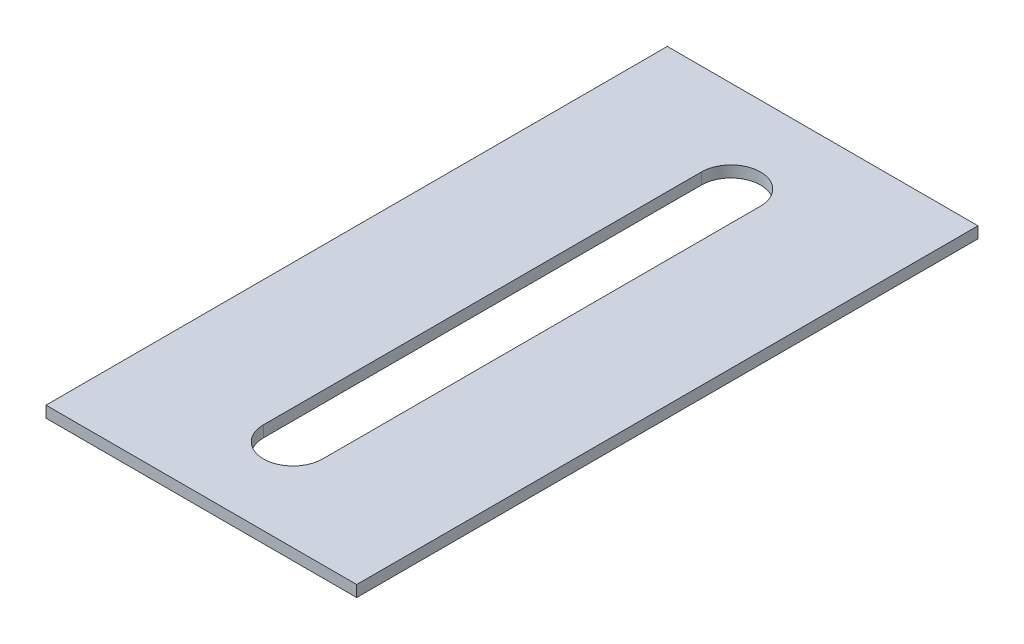
ISO-10303-21;
HEADER;
FILE_DESCRIPTION(('STEP AP214'),'2;1');
FILE_NAME('part.step','',(''),(''),'','','');
FILE_SCHEMA(('AUTOMOTIVE_DESIGN { 1 0 10303 214 1 1 1 1 }'));
ENDSEC;
DATA;
#1=APPLICATION_CONTEXT('core data for automotive mechanical design processes');
#2=APPLICATION_PROTOCOL_DEFINITION('international standard','automotive_design',2000,#1);
#3=PRODUCT_CONTEXT('',#1,'mechanical');
#4=PRODUCT('Part','Part','',(#3));
#5=PRODUCT_RELATED_PRODUCT_CATEGORY('part','',(#4));
#6=PRODUCT_DEFINITION_FORMATION('','',#4);
#7=PRODUCT_DEFINITION_CONTEXT('part definition',#1,'design');
#8=PRODUCT_DEFINITION('design','',#6,#7);
#9=PRODUCT_DEFINITION_SHAPE('','',#8);
#10=(LENGTH_UNIT() NAMED_UNIT(*) SI_UNIT(.MILLI.,.METRE.));
#11=(NAMED_UNIT(*) PLANE_ANGLE_UNIT() SI_UNIT($,.RADIAN.));
#12=(NAMED_UNIT(*) SI_UNIT($,.STERADIAN.) SOLID_ANGLE_UNIT());
#13=UNCERTAINTY_MEASURE_WITH_UNIT(LENGTH_MEASURE(1.E-05),#10,'distance_accuracy_value','');
#14=(GEOMETRIC_REPRESENTATION_CONTEXT(3) GLOBAL_UNCERTAINTY_ASSIGNED_CONTEXT((#13)) GLOBAL_UNIT_ASSIGNED_CONTEXT((#10,
#11,#12)) REPRESENTATION_CONTEXT('',''));
#15=CARTESIAN_POINT('',(0.,0.,0.));
#16=DIRECTION('',(0.,0.,1.));
#17=DIRECTION('',(1.,0.,0.));
#18=AXIS2_PLACEMENT_3D('',#15,#16,#17);
#19=CARTESIAN_POINT('',(25.,-0.9125,-50.));
#20=DIRECTION('',(1.,0.,0.));
#21=DIRECTION('',(0.,0.,-1.));
#22=AXIS2_PLACEMENT_3D('',#19,#20,#21);
#23=PLANE('',#22);
#24=DIRECTION('',(0.,1.,0.));
#25=VECTOR('',#24,1.);
#26=CARTESIAN_POINT('',(25.,-0.9125,-50.));
#27=LINE('',#26,#25);
#28=CARTESIAN_POINT('',(25.,-0.9125,-50.));
#29=VERTEX_POINT('',#28);
#30=CARTESIAN_POINT('',(25.,0.9125,-50.));
#31=VERTEX_POINT('',#30);
#32=EDGE_CURVE('E46',#29,#31,#27,.T.);
#33=ORIENTED_EDGE('',*,*,#32,.T.);
#34=DIRECTION('',(0.,0.,-1.));
#35=VECTOR('',#34,1.);
#36=CARTESIAN_POINT('',(25.,0.9125,-50.));
#37=LINE('',#36,#35);
#38=CARTESIAN_POINT('',(25.,0.9125,50.));
#39=VERTEX_POINT('',#38);
#40=EDGE_CURVE('E144',#39,#31,#37,.T.);
#41=ORIENTED_EDGE('',*,*,#40,.F.);
#42=DIRECTION('',(0.,1.,0.));
#43=VECTOR('',#42,1.);
#44=CARTESIAN_POINT('',(25.,-0.9125,50.));
#45=LINE('',#44,#43);
#46=CARTESIAN_POINT('',(25.,-0.9125,50.));
#47=VERTEX_POINT('',#46);
#48=EDGE_CURVE('E11',#47,#39,#45,.T.);
#49=ORIENTED_EDGE('',*,*,#48,.F.);
#50=DIRECTION('',(0.,0.,-1.));
#51=VECTOR('',#50,1.);
#52=CARTESIAN_POINT('',(25.,-0.9125,-50.));
#53=LINE('',#52,#51);
#54=EDGE_CURVE('E172',#47,#29,#53,.T.);
#55=ORIENTED_EDGE('',*,*,#54,.T.);
#56=EDGE_LOOP('',(#33,#41,#49,#55));
#57=FACE_BOUND('',#56,.T.);
#58=ADVANCED_FACE('F43',(#57),#23,.T.);
#59=CARTESIAN_POINT('',(-25.,-0.9125,50.));
#60=DIRECTION('',(0.,0.,1.));
#61=DIRECTION('',(1.,0.,0.));
#62=AXIS2_PLACEMENT_3D('',#59,#60,#61);
#63=PLANE('',#62);
#64=ORIENTED_EDGE('',*,*,#48,.T.);
#65=DIRECTION('',(1.,0.,0.));
#66=VECTOR('',#65,1.);
#67=CARTESIAN_POINT('',(-25.,0.9125,50.));
#68=LINE('',#67,#66);
#69=CARTESIAN_POINT('',(-25.,0.9125,50.));
#70=VERTEX_POINT('',#69);
#71=EDGE_CURVE('E156',#70,#39,#68,.T.);
#72=ORIENTED_EDGE('',*,*,#71,.F.);
#73=DIRECTION('',(0.,1.,0.));
#74=VECTOR('',#73,1.);
#75=CARTESIAN_POINT('',(-25.,-0.9125,50.));
#76=LINE('',#75,#74);
#77=CARTESIAN_POINT('',(-25.,-0.9125,50.));
#78=VERTEX_POINT('',#77);
#79=EDGE_CURVE('E52',#78,#70,#76,.T.);
#80=ORIENTED_EDGE('',*,*,#79,.F.);
#81=DIRECTION('',(1.,0.,0.));
#82=VECTOR('',#81,1.);
#83=CARTESIAN_POINT('',(-25.,-0.9125,50.));
#84=LINE('',#83,#82);
#85=EDGE_CURVE('E188',#78,#47,#84,.T.);
#86=ORIENTED_EDGE('',*,*,#85,.T.);
#87=EDGE_LOOP('',(#64,#72,#80,#86));
#88=FACE_BOUND('',#87,.T.);
#89=ADVANCED_FACE('F204',(#88),#63,.T.);
#90=CARTESIAN_POINT('',(-25.,-0.9125,-50.));
#91=DIRECTION('',(-1.,0.,0.));
#92=DIRECTION('',(0.,0.,1.));
#93=AXIS2_PLACEMENT_3D('',#90,#91,#92);
#94=PLANE('',#93);
#95=ORIENTED_EDGE('',*,*,#79,.T.);
#96=DIRECTION('',(0.,0.,1.));
#97=VECTOR('',#96,1.);
#98=CARTESIAN_POINT('',(-25.,0.9125,-50.));
#99=LINE('',#98,#97);
#100=CARTESIAN_POINT('',(-25.,0.9125,-50.));
#101=VERTEX_POINT('',#100);
#102=EDGE_CURVE('E152',#101,#70,#99,.T.);
#103=ORIENTED_EDGE('',*,*,#102,.F.);
#104=DIRECTION('',(0.,1.,0.));
#105=VECTOR('',#104,1.);
#106=CARTESIAN_POINT('',(-25.,-0.9125,-50.));
#107=LINE('',#106,#105);
#108=CARTESIAN_POINT('',(-25.,-0.9125,-50.));
#109=VERTEX_POINT('',#108);
#110=EDGE_CURVE('E193',#109,#101,#107,.T.);
#111=ORIENTED_EDGE('',*,*,#110,.F.);
#112=DIRECTION('',(0.,0.,1.));
#113=VECTOR('',#112,1.);
#114=CARTESIAN_POINT('',(-25.,-0.9125,-50.));
#115=LINE('',#114,#113);
#116=EDGE_CURVE('E184',#109,#78,#115,.T.);
#117=ORIENTED_EDGE('',*,*,#116,.T.);
#118=EDGE_LOOP('',(#95,#103,#111,#117));
#119=FACE_BOUND('',#118,.T.);
#120=ADVANCED_FACE('F210',(#119),#94,.T.);
#121=CARTESIAN_POINT('',(-25.,-0.9125,-50.));
#122=DIRECTION('',(0.,0.,-1.));
#123=DIRECTION('',(-1.,0.,0.));
#124=AXIS2_PLACEMENT_3D('',#121,#122,#123);
#125=PLANE('',#124);
#126=ORIENTED_EDGE('',*,*,#110,.T.);
#127=DIRECTION('',(-1.,0.,0.));
#128=VECTOR('',#127,1.);
#129=CARTESIAN_POINT('',(-25.,0.9125,-50.));
#130=LINE('',#129,#128);
#131=EDGE_CURVE('E148',#31,#101,#130,.T.);
#132=ORIENTED_EDGE('',*,*,#131,.F.);
#133=ORIENTED_EDGE('',*,*,#32,.F.);
#134=DIRECTION('',(-1.,0.,0.));
#135=VECTOR('',#134,1.);
#136=CARTESIAN_POINT('',(-25.,-0.9125,-50.));
#137=LINE('',#136,#135);
#138=EDGE_CURVE('E180',#29,#109,#137,.T.);
#139=ORIENTED_EDGE('',*,*,#138,.T.);
#140=EDGE_LOOP('',(#126,#132,#133,#139));
#141=FACE_BOUND('',#140,.T.);
#142=ADVANCED_FACE('F199',(#141),#125,.T.);
#143=CARTESIAN_POINT('',(0.,-0.9125,0.));
#144=DIRECTION('',(0.,1.,0.));
#145=DIRECTION('',(0.,0.,1.));
#146=AXIS2_PLACEMENT_3D('',#143,#144,#145);
#147=PLANE('',#146);
#148=DIRECTION('',(0.,0.,-1.));
#149=VECTOR('',#148,1.);
#150=CARTESIAN_POINT('',(4.7625,-0.9125,-35.2375));
#151=LINE('',#150,#149);
#152=CARTESIAN_POINT('',(4.76250000000001,-0.9125,35.2375));
#153=VERTEX_POINT('',#152);
#154=CARTESIAN_POINT('',(4.7625,-0.9125,-35.2375));
#155=VERTEX_POINT('',#154);
#156=EDGE_CURVE('E122',#153,#155,#151,.T.);
#157=ORIENTED_EDGE('',*,*,#156,.T.);
#158=CARTESIAN_POINT('',(0.,-0.9125,-35.2375));
#159=DIRECTION('',(0.,1.,0.));
#160=DIRECTION('',(0.,0.,1.));
#161=AXIS2_PLACEMENT_3D('',#158,#159,#160);
#162=CIRCLE('',#161,4.7625);
#163=CARTESIAN_POINT('',(-4.7625,-0.9125,-35.2375));
#164=VERTEX_POINT('',#163);
#165=EDGE_CURVE('E160',#155,#164,#162,.T.);
#166=ORIENTED_EDGE('',*,*,#165,.T.);
#167=DIRECTION('',(0.,0.,1.));
#168=VECTOR('',#167,1.);
#169=CARTESIAN_POINT('',(-4.7625,-0.9125,-35.2375));
#170=LINE('',#169,#168);
#171=CARTESIAN_POINT('',(-4.76249999999999,-0.9125,35.2375));
#172=VERTEX_POINT('',#171);
#173=EDGE_CURVE('E116',#164,#172,#170,.T.);
#174=ORIENTED_EDGE('',*,*,#173,.T.);
#175=CARTESIAN_POINT('',(0.,-0.9125,35.2375));
#176=DIRECTION('',(0.,1.,0.));
#177=DIRECTION('',(0.,0.,1.));
#178=AXIS2_PLACEMENT_3D('',#175,#176,#177);
#179=CIRCLE('',#178,4.7625);
#180=EDGE_CURVE('E60',#172,#153,#179,.T.);
#181=ORIENTED_EDGE('',*,*,#180,.T.);
#182=EDGE_LOOP('',(#157,#166,#174,#181));
#183=FACE_BOUND('',#182,.T.);
#184=ORIENTED_EDGE('',*,*,#54,.F.);
#185=ORIENTED_EDGE('',*,*,#85,.F.);
#186=ORIENTED_EDGE('',*,*,#116,.F.);
#187=ORIENTED_EDGE('',*,*,#138,.F.);
#188=EDGE_LOOP('',(#184,#185,#186,#187));
#189=FACE_BOUND('',#188,.T.);
#190=ADVANCED_FACE('F208',(#183,#189),#147,.F.);
#191=CARTESIAN_POINT('',(0.,-0.9125,-35.2375));
#192=DIRECTION('',(0.,1.,0.));
#193=DIRECTION('',(0.,0.,1.));
#194=AXIS2_PLACEMENT_3D('',#191,#192,#193);
#195=CYLINDRICAL_SURFACE('',#194,4.7625);
#196=DIRECTION('',(0.,1.,0.));
#197=VECTOR('',#196,1.);
#198=CARTESIAN_POINT('',(4.7625,-0.9125,-35.2375));
#199=LINE('',#198,#197);
#200=CARTESIAN_POINT('',(4.7625,0.9125,-35.2375));
#201=VERTEX_POINT('',#200);
#202=EDGE_CURVE('E127',#155,#201,#199,.T.);
#203=ORIENTED_EDGE('',*,*,#202,.T.);
#204=CARTESIAN_POINT('',(0.,0.9125,-35.2375));
#205=DIRECTION('',(0.,1.,0.));
#206=DIRECTION('',(0.,0.,1.));
#207=AXIS2_PLACEMENT_3D('',#204,#205,#206);
#208=CIRCLE('',#207,4.7625);
#209=CARTESIAN_POINT('',(-4.7625,0.9125,-35.2375));
#210=VERTEX_POINT('',#209);
#211=EDGE_CURVE('E125',#201,#210,#208,.T.);
#212=ORIENTED_EDGE('',*,*,#211,.T.);
#213=DIRECTION('',(0.,1.,0.));
#214=VECTOR('',#213,1.);
#215=CARTESIAN_POINT('',(-4.7625,-0.9125,-35.2375));
#216=LINE('',#215,#214);
#217=EDGE_CURVE('E109',#164,#210,#216,.T.);
#218=ORIENTED_EDGE('',*,*,#217,.F.);
#219=ORIENTED_EDGE('',*,*,#165,.F.);
#220=EDGE_LOOP('',(#203,#212,#218,#219));
#221=FACE_BOUND('',#220,.T.);
#222=ADVANCED_FACE('F126',(#221),#195,.F.);
#223=CARTESIAN_POINT('',(4.7625,-0.9125,-35.2375));
#224=DIRECTION('',(1.,0.,0.));
#225=DIRECTION('',(0.,0.,-1.));
#226=AXIS2_PLACEMENT_3D('',#223,#224,#225);
#227=PLANE('',#226);
#228=DIRECTION('',(0.,1.,0.));
#229=VECTOR('',#228,1.);
#230=CARTESIAN_POINT('',(4.76250000000001,-0.9125,35.2375));
#231=LINE('',#230,#229);
#232=CARTESIAN_POINT('',(4.76250000000001,0.9125,35.2375));
#233=VERTEX_POINT('',#232);
#234=EDGE_CURVE('E173',#153,#233,#231,.T.);
#235=ORIENTED_EDGE('',*,*,#234,.T.);
#236=DIRECTION('',(0.,0.,-1.));
#237=VECTOR('',#236,1.);
#238=CARTESIAN_POINT('',(4.7625,0.9125,-35.2375));
#239=LINE('',#238,#237);
#240=EDGE_CURVE('E139',#233,#201,#239,.T.);
#241=ORIENTED_EDGE('',*,*,#240,.T.);
#242=ORIENTED_EDGE('',*,*,#202,.F.);
#243=ORIENTED_EDGE('',*,*,#156,.F.);
#244=EDGE_LOOP('',(#235,#241,#242,#243));
#245=FACE_BOUND('',#244,.T.);
#246=ADVANCED_FACE('F257',(#245),#227,.F.);
#247=CARTESIAN_POINT('',(0.,-0.9125,35.2375));
#248=DIRECTION('',(0.,1.,0.));
#249=DIRECTION('',(0.,0.,1.));
#250=AXIS2_PLACEMENT_3D('',#247,#248,#249);
#251=CYLINDRICAL_SURFACE('',#250,4.7625);
#252=DIRECTION('',(0.,1.,0.));
#253=VECTOR('',#252,1.);
#254=CARTESIAN_POINT('',(-4.76249999999999,-0.9125,35.2375));
#255=LINE('',#254,#253);
#256=CARTESIAN_POINT('',(-4.76249999999999,0.9125,35.2375));
#257=VERTEX_POINT('',#256);
#258=EDGE_CURVE('E121',#172,#257,#255,.T.);
#259=ORIENTED_EDGE('',*,*,#258,.T.);
#260=CARTESIAN_POINT('',(0.,0.9125,35.2375));
#261=DIRECTION('',(0.,1.,0.));
#262=DIRECTION('',(0.,0.,1.));
#263=AXIS2_PLACEMENT_3D('',#260,#261,#262);
#264=CIRCLE('',#263,4.7625);
#265=EDGE_CURVE('E135',#257,#233,#264,.T.);
#266=ORIENTED_EDGE('',*,*,#265,.T.);
#267=ORIENTED_EDGE('',*,*,#234,.F.);
#268=ORIENTED_EDGE('',*,*,#180,.F.);
#269=EDGE_LOOP('',(#259,#266,#267,#268));
#270=FACE_BOUND('',#269,.T.);
#271=ADVANCED_FACE('F267',(#270),#251,.F.);
#272=CARTESIAN_POINT('',(-4.7625,-0.9125,-35.2375));
#273=DIRECTION('',(-1.,0.,0.));
#274=DIRECTION('',(0.,0.,1.));
#275=AXIS2_PLACEMENT_3D('',#272,#273,#274);
#276=PLANE('',#275);
#277=ORIENTED_EDGE('',*,*,#217,.T.);
#278=DIRECTION('',(0.,0.,1.));
#279=VECTOR('',#278,1.);
#280=CARTESIAN_POINT('',(-4.7625,0.9125,-35.2375));
#281=LINE('',#280,#279);
#282=EDGE_CURVE('E113',#210,#257,#281,.T.);
#283=ORIENTED_EDGE('',*,*,#282,.T.);
#284=ORIENTED_EDGE('',*,*,#258,.F.);
#285=ORIENTED_EDGE('',*,*,#173,.F.);
#286=EDGE_LOOP('',(#277,#283,#284,#285));
#287=FACE_BOUND('',#286,.T.);
#288=ADVANCED_FACE('F111',(#287),#276,.F.);
#289=CARTESIAN_POINT('',(0.,0.9125,0.));
#290=DIRECTION('',(0.,1.,0.));
#291=DIRECTION('',(0.,0.,1.));
#292=AXIS2_PLACEMENT_3D('',#289,#290,#291);
#293=PLANE('',#292);
#294=ORIENTED_EDGE('',*,*,#40,.T.);
#295=ORIENTED_EDGE('',*,*,#131,.T.);
#296=ORIENTED_EDGE('',*,*,#102,.T.);
#297=ORIENTED_EDGE('',*,*,#71,.T.);
#298=EDGE_LOOP('',(#294,#295,#296,#297));
#299=FACE_BOUND('',#298,.T.);
#300=ORIENTED_EDGE('',*,*,#282,.F.);
#301=ORIENTED_EDGE('',*,*,#211,.F.);
#302=ORIENTED_EDGE('',*,*,#240,.F.);
#303=ORIENTED_EDGE('',*,*,#265,.F.);
#304=EDGE_LOOP('',(#300,#301,#302,#303));
#305=FACE_BOUND('',#304,.T.);
#306=ADVANCED_FACE('F133',(#299,#305),#293,.T.);
#307=CLOSED_SHELL('',(#58,#89,#120,#142,#190,#222,#246,#271,#288,#306));
#308=MANIFOLD_SOLID_BREP('B2',#307);
#309=ADVANCED_BREP_SHAPE_REPRESENTATION('',(#18,#308),#14);
#310=SHAPE_DEFINITION_REPRESENTATION(#9,#309);
ENDSEC;
END-ISO-10303-21;
